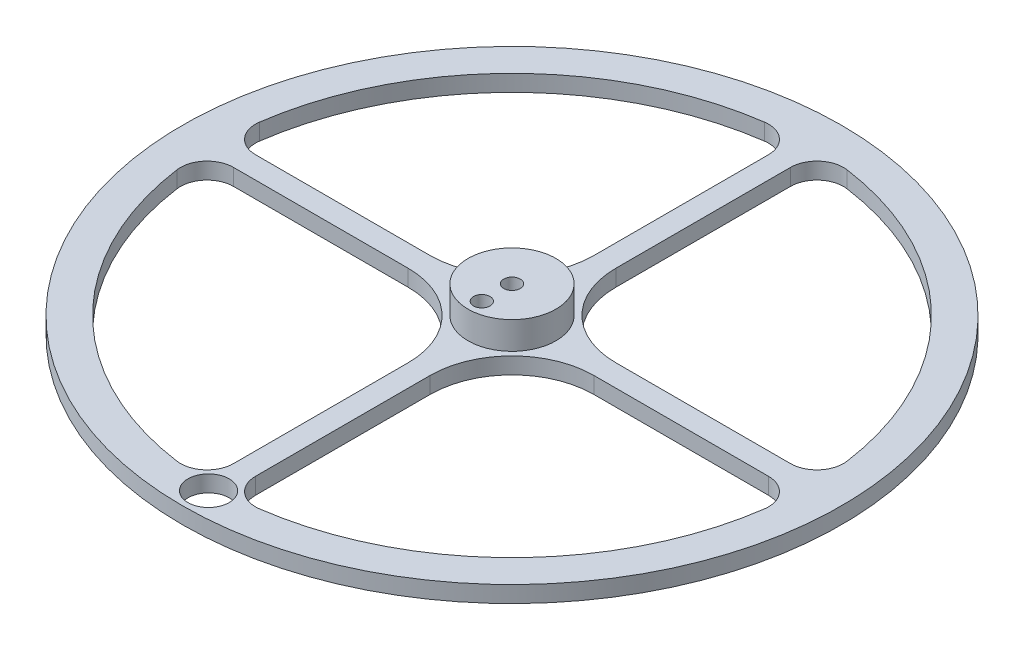
ISO-10303-21;
HEADER;
FILE_DESCRIPTION(('STEP AP214'),'2;1');
FILE_NAME('part.step','',(''),(''),'','','');
FILE_SCHEMA(('AUTOMOTIVE_DESIGN { 1 0 10303 214 1 1 1 1 }'));
ENDSEC;
DATA;
#1=APPLICATION_CONTEXT('core data for automotive mechanical design processes');
#2=APPLICATION_PROTOCOL_DEFINITION('international standard','automotive_design',2000,#1);
#3=PRODUCT_CONTEXT('',#1,'mechanical');
#4=PRODUCT('Part','Part','',(#3));
#5=PRODUCT_RELATED_PRODUCT_CATEGORY('part','',(#4));
#6=PRODUCT_DEFINITION_FORMATION('','',#4);
#7=PRODUCT_DEFINITION_CONTEXT('part definition',#1,'design');
#8=PRODUCT_DEFINITION('design','',#6,#7);
#9=PRODUCT_DEFINITION_SHAPE('','',#8);
#10=(LENGTH_UNIT() NAMED_UNIT(*) SI_UNIT(.MILLI.,.METRE.));
#11=(NAMED_UNIT(*) PLANE_ANGLE_UNIT() SI_UNIT($,.RADIAN.));
#12=(NAMED_UNIT(*) SI_UNIT($,.STERADIAN.) SOLID_ANGLE_UNIT());
#13=UNCERTAINTY_MEASURE_WITH_UNIT(LENGTH_MEASURE(1.E-05),#10,'distance_accuracy_value','');
#14=(GEOMETRIC_REPRESENTATION_CONTEXT(3) GLOBAL_UNCERTAINTY_ASSIGNED_CONTEXT((#13)) GLOBAL_UNIT_ASSIGNED_CONTEXT((#10,
#11,#12)) REPRESENTATION_CONTEXT('',''));
#15=CARTESIAN_POINT('',(0.,0.,0.));
#16=DIRECTION('',(0.,0.,1.));
#17=DIRECTION('',(1.,0.,0.));
#18=AXIS2_PLACEMENT_3D('',#15,#16,#17);
#19=CARTESIAN_POINT('',(0.,0.,0.));
#20=DIRECTION('',(0.,1.,0.));
#21=DIRECTION('',(0.,0.,1.));
#22=AXIS2_PLACEMENT_3D('',#19,#20,#21);
#23=PLANE('',#22);
#24=CARTESIAN_POINT('',(0.,0.,55.25));
#25=DIRECTION('',(0.,1.,0.));
#26=DIRECTION('',(0.,0.,1.));
#27=AXIS2_PLACEMENT_3D('',#24,#25,#26);
#28=CIRCLE('',#27,3.75);
#29=CARTESIAN_POINT('',(0.,0.,59.));
#30=VERTEX_POINT('',#29);
#31=EDGE_CURVE('E820',#30,#30,#28,.T.);
#32=ORIENTED_EDGE('',*,*,#31,.F.);
#33=EDGE_LOOP('',(#32));
#34=FACE_BOUND('',#33,.T.);
#35=CARTESIAN_POINT('',(0.,0.,0.));
#36=DIRECTION('',(0.,1.,0.));
#37=DIRECTION('',(0.,0.,1.));
#38=AXIS2_PLACEMENT_3D('',#35,#36,#37);
#39=CIRCLE('',#38,60.);
#40=CARTESIAN_POINT('',(0.,0.,60.));
#41=VERTEX_POINT('',#40);
#42=EDGE_CURVE('E249',#41,#41,#39,.T.);
#43=ORIENTED_EDGE('',*,*,#42,.T.);
#44=EDGE_LOOP('',(#43));
#45=FACE_BOUND('',#44,.T.);
#46=CARTESIAN_POINT('',(16.8994944431473,0.,16.8994944431475));
#47=DIRECTION('',(0.,1.,0.));
#48=DIRECTION('',(0.,0.,1.));
#49=AXIS2_PLACEMENT_3D('',#46,#47,#48);
#50=CIRCLE('',#49,14.8994942387478);
#51=CARTESIAN_POINT('',(16.8994944431474,0.,2.00000020439968));
#52=VERTEX_POINT('',#51);
#53=CARTESIAN_POINT('',(2.00000020439951,0.,16.8994944431475));
#54=VERTEX_POINT('',#53);
#55=EDGE_CURVE('E386',#52,#54,#50,.T.);
#56=ORIENTED_EDGE('',*,*,#55,.F.);
#57=DIRECTION('',(1.,0.,0.));
#58=VECTOR('',#57,1.);
#59=CARTESIAN_POINT('',(0.,0.,2.00000020439951));
#60=LINE('',#59,#58);
#61=CARTESIAN_POINT('',(48.6941677054723,0.,2.00000020440002));
#62=VERTEX_POINT('',#61);
#63=EDGE_CURVE('E389',#52,#62,#60,.T.);
#64=ORIENTED_EDGE('',*,*,#63,.T.);
#65=CARTESIAN_POINT('',(48.6941677054722,0.,6.82926831761021));
#66=DIRECTION('',(0.,1.,0.));
#67=DIRECTION('',(0.,0.,1.));
#68=AXIS2_PLACEMENT_3D('',#65,#66,#67);
#69=CIRCLE('',#68,4.82926811321019);
#70=CARTESIAN_POINT('',(53.4766304099276,0.,7.50000000000056));
#71=VERTEX_POINT('',#70);
#72=EDGE_CURVE('E393',#62,#71,#69,.F.);
#73=ORIENTED_EDGE('',*,*,#72,.T.);
#74=CARTESIAN_POINT('',(0.,0.,0.));
#75=DIRECTION('',(0.,1.,0.));
#76=DIRECTION('',(0.,0.,1.));
#77=AXIS2_PLACEMENT_3D('',#74,#75,#76);
#78=CIRCLE('',#77,54.);
#79=CARTESIAN_POINT('',(7.5,0.,53.4766304099277));
#80=VERTEX_POINT('',#79);
#81=EDGE_CURVE('E327',#80,#71,#78,.T.);
#82=ORIENTED_EDGE('',*,*,#81,.F.);
#83=CARTESIAN_POINT('',(6.8292683176097,0.,48.6941677054723));
#84=DIRECTION('',(0.,1.,0.));
#85=DIRECTION('',(0.,0.,1.));
#86=AXIS2_PLACEMENT_3D('',#83,#84,#85);
#87=CIRCLE('',#86,4.82926811321019);
#88=CARTESIAN_POINT('',(2.00000020439951,0.,48.6941677054723));
#89=VERTEX_POINT('',#88);
#90=EDGE_CURVE('E225',#89,#80,#87,.T.);
#91=ORIENTED_EDGE('',*,*,#90,.F.);
#92=DIRECTION('',(0.,0.,-1.));
#93=VECTOR('',#92,1.);
#94=CARTESIAN_POINT('',(2.00000020439951,0.,0.));
#95=LINE('',#94,#93);
#96=EDGE_CURVE('E257',#89,#54,#95,.T.);
#97=ORIENTED_EDGE('',*,*,#96,.T.);
#98=EDGE_LOOP('',(#56,#64,#73,#82,#91,#97));
#99=FACE_BOUND('',#98,.T.);
#100=CARTESIAN_POINT('',(53.4766304099277,0.,-7.49999999999944));
#101=VERTEX_POINT('',#100);
#102=CARTESIAN_POINT('',(7.50000000000037,0.,-53.4766304099276));
#103=VERTEX_POINT('',#102);
#104=EDGE_CURVE('E366',#101,#103,#78,.T.);
#105=ORIENTED_EDGE('',*,*,#104,.F.);
#106=CARTESIAN_POINT('',(48.6941677054724,0.,-6.82926831760919));
#107=DIRECTION('',(0.,1.,0.));
#108=DIRECTION('',(0.,0.,1.));
#109=AXIS2_PLACEMENT_3D('',#106,#107,#108);
#110=CIRCLE('',#109,4.82926811321019);
#111=CARTESIAN_POINT('',(48.6941677054723,0.,-2.000000204399));
#112=VERTEX_POINT('',#111);
#113=EDGE_CURVE('E367',#112,#101,#110,.T.);
#114=ORIENTED_EDGE('',*,*,#113,.F.);
#115=DIRECTION('',(-1.,0.,0.));
#116=VECTOR('',#115,1.);
#117=CARTESIAN_POINT('',(0.,0.,-2.00000020439951));
#118=LINE('',#117,#116);
#119=CARTESIAN_POINT('',(16.8994944431475,0.,-2.00000020439933));
#120=VERTEX_POINT('',#119);
#121=EDGE_CURVE('E370',#112,#120,#118,.T.);
#122=ORIENTED_EDGE('',*,*,#121,.T.);
#123=CARTESIAN_POINT('',(16.8994944431476,0.,-16.8994944431471));
#124=DIRECTION('',(0.,1.,0.));
#125=DIRECTION('',(0.,0.,1.));
#126=AXIS2_PLACEMENT_3D('',#123,#124,#125);
#127=CIRCLE('',#126,14.8994942387478);
#128=CARTESIAN_POINT('',(2.00000020439962,0.,-16.8994944431474));
#129=VERTEX_POINT('',#128);
#130=EDGE_CURVE('E374',#129,#120,#127,.T.);
#131=ORIENTED_EDGE('',*,*,#130,.F.);
#132=DIRECTION('',(0.,0.,-1.));
#133=VECTOR('',#132,1.);
#134=CARTESIAN_POINT('',(2.0000002043995,0.,0.));
#135=LINE('',#134,#133);
#136=CARTESIAN_POINT('',(2.00000020439984,0.,-48.6941677054723));
#137=VERTEX_POINT('',#136);
#138=EDGE_CURVE('E378',#129,#137,#135,.T.);
#139=ORIENTED_EDGE('',*,*,#138,.T.);
#140=CARTESIAN_POINT('',(6.82926831761003,0.,-48.6941677054722));
#141=DIRECTION('',(0.,1.,0.));
#142=DIRECTION('',(0.,0.,1.));
#143=AXIS2_PLACEMENT_3D('',#140,#141,#142);
#144=CIRCLE('',#143,4.82926811321019);
#145=EDGE_CURVE('E382',#137,#103,#144,.F.);
#146=ORIENTED_EDGE('',*,*,#145,.T.);
#147=EDGE_LOOP('',(#105,#114,#122,#131,#139,#146));
#148=FACE_BOUND('',#147,.T.);
#149=CARTESIAN_POINT('',(-7.49999999999963,0.,-53.4766304099277));
#150=VERTEX_POINT('',#149);
#151=CARTESIAN_POINT('',(-53.4766304099276,0.,-7.50000000000019));
#152=VERTEX_POINT('',#151);
#153=EDGE_CURVE('E328',#150,#152,#78,.T.);
#154=ORIENTED_EDGE('',*,*,#153,.F.);
#155=CARTESIAN_POINT('',(-6.82926831760936,0.,-48.6941677054723));
#156=DIRECTION('',(0.,1.,0.));
#157=DIRECTION('',(0.,0.,1.));
#158=AXIS2_PLACEMENT_3D('',#155,#156,#157);
#159=CIRCLE('',#158,4.82926811321019);
#160=CARTESIAN_POINT('',(-2.00000020439917,0.,-48.6941677054723));
#161=VERTEX_POINT('',#160);
#162=EDGE_CURVE('E347',#161,#150,#159,.T.);
#163=ORIENTED_EDGE('',*,*,#162,.F.);
#164=DIRECTION('',(0.,0.,1.));
#165=VECTOR('',#164,1.);
#166=CARTESIAN_POINT('',(-2.00000020439951,0.,0.));
#167=LINE('',#166,#165);
#168=CARTESIAN_POINT('',(-2.00000020439939,0.,-16.8994944431475));
#169=VERTEX_POINT('',#168);
#170=EDGE_CURVE('E350',#161,#169,#167,.T.);
#171=ORIENTED_EDGE('',*,*,#170,.T.);
#172=CARTESIAN_POINT('',(-16.8994944431471,0.,-16.8994944431476));
#173=DIRECTION('',(0.,1.,0.));
#174=DIRECTION('',(0.,0.,1.));
#175=AXIS2_PLACEMENT_3D('',#172,#173,#174);
#176=CIRCLE('',#175,14.8994942387478);
#177=CARTESIAN_POINT('',(-16.8994944431475,0.,-2.00000020439957));
#178=VERTEX_POINT('',#177);
#179=EDGE_CURVE('E354',#178,#169,#176,.T.);
#180=ORIENTED_EDGE('',*,*,#179,.F.);
#181=DIRECTION('',(-1.,0.,0.));
#182=VECTOR('',#181,1.);
#183=CARTESIAN_POINT('',(0.,0.,-2.00000020439951));
#184=LINE('',#183,#182);
#185=CARTESIAN_POINT('',(-48.6941677054723,0.,-2.00000020439968));
#186=VERTEX_POINT('',#185);
#187=EDGE_CURVE('E358',#178,#186,#184,.T.);
#188=ORIENTED_EDGE('',*,*,#187,.T.);
#189=CARTESIAN_POINT('',(-48.6941677054723,0.,-6.82926831760987));
#190=DIRECTION('',(0.,1.,0.));
#191=DIRECTION('',(0.,0.,1.));
#192=AXIS2_PLACEMENT_3D('',#189,#190,#191);
#193=CIRCLE('',#192,4.82926811321019);
#194=EDGE_CURVE('E362',#186,#152,#193,.F.);
#195=ORIENTED_EDGE('',*,*,#194,.T.);
#196=EDGE_LOOP('',(#154,#163,#171,#180,#188,#195));
#197=FACE_BOUND('',#196,.T.);
#198=CARTESIAN_POINT('',(-53.4766304099277,0.,7.49999999999981));
#199=VERTEX_POINT('',#198);
#200=CARTESIAN_POINT('',(-7.5,0.,53.4766304099277));
#201=VERTEX_POINT('',#200);
#202=EDGE_CURVE('E321',#199,#201,#78,.T.);
#203=ORIENTED_EDGE('',*,*,#202,.F.);
#204=CARTESIAN_POINT('',(-48.6941677054723,0.,6.82926831760953));
#205=DIRECTION('',(0.,1.,0.));
#206=DIRECTION('',(0.,0.,1.));
#207=AXIS2_PLACEMENT_3D('',#204,#205,#206);
#208=CIRCLE('',#207,4.8292681132102);
#209=CARTESIAN_POINT('',(-48.6941677054723,0.,2.00000020439934));
#210=VERTEX_POINT('',#209);
#211=EDGE_CURVE('E325',#210,#199,#208,.T.);
#212=ORIENTED_EDGE('',*,*,#211,.F.);
#213=DIRECTION('',(1.,0.,0.));
#214=VECTOR('',#213,1.);
#215=CARTESIAN_POINT('',(0.,0.,2.00000020439951));
#216=LINE('',#215,#214);
#217=CARTESIAN_POINT('',(-16.8994944431475,0.,2.00000020439945));
#218=VERTEX_POINT('',#217);
#219=EDGE_CURVE('E331',#210,#218,#216,.T.);
#220=ORIENTED_EDGE('',*,*,#219,.T.);
#221=CARTESIAN_POINT('',(-16.8994944431472,0.,16.8994944431475));
#222=DIRECTION('',(0.,1.,0.));
#223=DIRECTION('',(0.,0.,1.));
#224=AXIS2_PLACEMENT_3D('',#221,#222,#223);
#225=CIRCLE('',#224,14.8994942387477);
#226=CARTESIAN_POINT('',(-2.00000020439951,0.,16.8994944431475));
#227=VERTEX_POINT('',#226);
#228=EDGE_CURVE('E335',#227,#218,#225,.T.);
#229=ORIENTED_EDGE('',*,*,#228,.F.);
#230=DIRECTION('',(0.,0.,1.));
#231=VECTOR('',#230,1.);
#232=CARTESIAN_POINT('',(-2.00000020439951,0.,0.));
#233=LINE('',#232,#231);
#234=CARTESIAN_POINT('',(-2.00000020439951,0.,48.6941677054723));
#235=VERTEX_POINT('',#234);
#236=EDGE_CURVE('E339',#227,#235,#233,.T.);
#237=ORIENTED_EDGE('',*,*,#236,.T.);
#238=CARTESIAN_POINT('',(-6.8292683176097,0.,48.6941677054723));
#239=DIRECTION('',(0.,1.,0.));
#240=DIRECTION('',(0.,0.,1.));
#241=AXIS2_PLACEMENT_3D('',#238,#239,#240);
#242=CIRCLE('',#241,4.82926811321019);
#243=EDGE_CURVE('E343',#235,#201,#242,.F.);
#244=ORIENTED_EDGE('',*,*,#243,.T.);
#245=EDGE_LOOP('',(#203,#212,#220,#229,#237,#244));
#246=FACE_BOUND('',#245,.T.);
#247=CARTESIAN_POINT('',(0.,0.,0.));
#248=DIRECTION('',(0.,1.,0.));
#249=DIRECTION('',(0.,0.,1.));
#250=AXIS2_PLACEMENT_3D('',#247,#248,#249);
#251=CIRCLE('',#250,8.);
#252=CARTESIAN_POINT('',(0.,0.,8.));
#253=VERTEX_POINT('',#252);
#254=EDGE_CURVE('E842',#253,#253,#251,.T.);
#255=ORIENTED_EDGE('',*,*,#254,.F.);
#256=EDGE_LOOP('',(#255));
#257=FACE_BOUND('',#256,.T.);
#258=ADVANCED_FACE('F41',(#34,#45,#99,#148,#197,#246,#257),#23,.T.);
#259=CARTESIAN_POINT('',(16.8994944431473,-3.,16.8994944431475));
#260=DIRECTION('',(0.,1.,0.));
#261=DIRECTION('',(0.,0.,1.));
#262=AXIS2_PLACEMENT_3D('',#259,#260,#261);
#263=CYLINDRICAL_SURFACE('',#262,14.8994942387478);
#264=ORIENTED_EDGE('',*,*,#55,.T.);
#265=DIRECTION('',(0.,1.,0.));
#266=VECTOR('',#265,1.);
#267=CARTESIAN_POINT('',(2.00000020439951,-3.,16.8994944431475));
#268=LINE('',#267,#266);
#269=CARTESIAN_POINT('',(2.00000020439951,-3.,16.8994944431475));
#270=VERTEX_POINT('',#269);
#271=EDGE_CURVE('E11',#270,#54,#268,.T.);
#272=ORIENTED_EDGE('',*,*,#271,.F.);
#273=CARTESIAN_POINT('',(16.8994944431473,-3.,16.8994944431475));
#274=DIRECTION('',(0.,1.,0.));
#275=DIRECTION('',(0.,0.,1.));
#276=AXIS2_PLACEMENT_3D('',#273,#274,#275);
#277=CIRCLE('',#276,14.8994942387478);
#278=CARTESIAN_POINT('',(16.8994944431474,-3.,2.00000020439968));
#279=VERTEX_POINT('',#278);
#280=EDGE_CURVE('E61',#279,#270,#277,.T.);
#281=ORIENTED_EDGE('',*,*,#280,.F.);
#282=DIRECTION('',(0.,1.,0.));
#283=VECTOR('',#282,1.);
#284=CARTESIAN_POINT('',(16.8994944431474,-3.,2.00000020439968));
#285=LINE('',#284,#283);
#286=EDGE_CURVE('E409',#279,#52,#285,.T.);
#287=ORIENTED_EDGE('',*,*,#286,.T.);
#288=EDGE_LOOP('',(#264,#272,#281,#287));
#289=FACE_BOUND('',#288,.T.);
#290=ADVANCED_FACE('F530',(#289),#263,.F.);
#291=CARTESIAN_POINT('',(2.00000020439951,-3.,0.));
#292=DIRECTION('',(1.,0.,0.));
#293=DIRECTION('',(0.,0.,-1.));
#294=AXIS2_PLACEMENT_3D('',#291,#292,#293);
#295=PLANE('',#294);
#296=ORIENTED_EDGE('',*,*,#96,.F.);
#297=DIRECTION('',(0.,1.,0.));
#298=VECTOR('',#297,1.);
#299=CARTESIAN_POINT('',(2.00000020439951,-3.,48.6941677054723));
#300=LINE('',#299,#298);
#301=CARTESIAN_POINT('',(2.00000020439951,-3.,48.6941677054723));
#302=VERTEX_POINT('',#301);
#303=EDGE_CURVE('E52',#302,#89,#300,.T.);
#304=ORIENTED_EDGE('',*,*,#303,.F.);
#305=DIRECTION('',(0.,0.,-1.));
#306=VECTOR('',#305,1.);
#307=CARTESIAN_POINT('',(2.00000020439951,-3.,0.));
#308=LINE('',#307,#306);
#309=EDGE_CURVE('E219',#302,#270,#308,.T.);
#310=ORIENTED_EDGE('',*,*,#309,.T.);
#311=ORIENTED_EDGE('',*,*,#271,.T.);
#312=EDGE_LOOP('',(#296,#304,#310,#311));
#313=FACE_BOUND('',#312,.T.);
#314=ADVANCED_FACE('F531',(#313),#295,.T.);
#315=CARTESIAN_POINT('',(6.8292683176097,-3.,48.6941677054723));
#316=DIRECTION('',(0.,1.,0.));
#317=DIRECTION('',(0.,0.,1.));
#318=AXIS2_PLACEMENT_3D('',#315,#316,#317);
#319=CYLINDRICAL_SURFACE('',#318,4.82926811321019);
#320=ORIENTED_EDGE('',*,*,#90,.T.);
#321=DIRECTION('',(0.,1.,0.));
#322=VECTOR('',#321,1.);
#323=CARTESIAN_POINT('',(7.5,-3.,53.4766304099277));
#324=LINE('',#323,#322);
#325=CARTESIAN_POINT('',(7.5,-3.,53.4766304099277));
#326=VERTEX_POINT('',#325);
#327=EDGE_CURVE('E223',#326,#80,#324,.T.);
#328=ORIENTED_EDGE('',*,*,#327,.F.);
#329=CARTESIAN_POINT('',(6.8292683176097,-3.,48.6941677054723));
#330=DIRECTION('',(0.,1.,0.));
#331=DIRECTION('',(0.,0.,1.));
#332=AXIS2_PLACEMENT_3D('',#329,#330,#331);
#333=CIRCLE('',#332,4.82926811321019);
#334=EDGE_CURVE('E211',#302,#326,#333,.T.);
#335=ORIENTED_EDGE('',*,*,#334,.F.);
#336=ORIENTED_EDGE('',*,*,#303,.T.);
#337=EDGE_LOOP('',(#320,#328,#335,#336));
#338=FACE_BOUND('',#337,.T.);
#339=ADVANCED_FACE('F224',(#338),#319,.F.);
#340=CARTESIAN_POINT('',(0.,-3.,0.));
#341=DIRECTION('',(0.,1.,0.));
#342=DIRECTION('',(0.,0.,1.));
#343=AXIS2_PLACEMENT_3D('',#340,#341,#342);
#344=CYLINDRICAL_SURFACE('',#343,54.);
#345=ORIENTED_EDGE('',*,*,#81,.T.);
#346=DIRECTION('',(0.,1.,0.));
#347=VECTOR('',#346,1.);
#348=CARTESIAN_POINT('',(53.4766304099276,-3.,7.50000000000056));
#349=LINE('',#348,#347);
#350=CARTESIAN_POINT('',(53.4766304099276,-3.,7.50000000000056));
#351=VERTEX_POINT('',#350);
#352=EDGE_CURVE('E230',#351,#71,#349,.T.);
#353=ORIENTED_EDGE('',*,*,#352,.F.);
#354=CARTESIAN_POINT('',(0.,-3.,0.));
#355=DIRECTION('',(0.,1.,0.));
#356=DIRECTION('',(0.,0.,1.));
#357=AXIS2_PLACEMENT_3D('',#354,#355,#356);
#358=CIRCLE('',#357,54.);
#359=EDGE_CURVE('E217',#326,#351,#358,.T.);
#360=ORIENTED_EDGE('',*,*,#359,.F.);
#361=ORIENTED_EDGE('',*,*,#327,.T.);
#362=EDGE_LOOP('',(#345,#353,#360,#361));
#363=FACE_BOUND('',#362,.T.);
#364=ADVANCED_FACE('F232',(#363),#344,.F.);
#365=CARTESIAN_POINT('',(48.6941677054722,-3.,6.82926831761021));
#366=DIRECTION('',(0.,1.,0.));
#367=DIRECTION('',(0.,0.,1.));
#368=AXIS2_PLACEMENT_3D('',#365,#366,#367);
#369=CYLINDRICAL_SURFACE('',#368,4.82926811321019);
#370=ORIENTED_EDGE('',*,*,#72,.F.);
#371=DIRECTION('',(0.,1.,0.));
#372=VECTOR('',#371,1.);
#373=CARTESIAN_POINT('',(48.6941677054723,-3.,2.00000020440002));
#374=LINE('',#373,#372);
#375=CARTESIAN_POINT('',(48.6941677054723,-3.,2.00000020440002));
#376=VERTEX_POINT('',#375);
#377=EDGE_CURVE('E406',#376,#62,#374,.T.);
#378=ORIENTED_EDGE('',*,*,#377,.F.);
#379=CARTESIAN_POINT('',(48.6941677054722,-3.,6.82926831761021));
#380=DIRECTION('',(0.,1.,0.));
#381=DIRECTION('',(0.,0.,1.));
#382=AXIS2_PLACEMENT_3D('',#379,#380,#381);
#383=CIRCLE('',#382,4.82926811321019);
#384=EDGE_CURVE('E235',#376,#351,#383,.F.);
#385=ORIENTED_EDGE('',*,*,#384,.T.);
#386=ORIENTED_EDGE('',*,*,#352,.T.);
#387=EDGE_LOOP('',(#370,#378,#385,#386));
#388=FACE_BOUND('',#387,.T.);
#389=ADVANCED_FACE('F526',(#388),#369,.F.);
#390=ORIENTED_EDGE('',*,*,#104,.T.);
#391=DIRECTION('',(0.,1.,0.));
#392=VECTOR('',#391,1.);
#393=CARTESIAN_POINT('',(7.50000000000037,-3.,-53.4766304099276));
#394=LINE('',#393,#392);
#395=CARTESIAN_POINT('',(7.50000000000037,-3.,-53.4766304099276));
#396=VERTEX_POINT('',#395);
#397=EDGE_CURVE('E412',#396,#103,#394,.T.);
#398=ORIENTED_EDGE('',*,*,#397,.F.);
#399=CARTESIAN_POINT('',(53.4766304099277,-3.,-7.49999999999944));
#400=VERTEX_POINT('',#399);
#401=EDGE_CURVE('E237',#400,#396,#358,.T.);
#402=ORIENTED_EDGE('',*,*,#401,.F.);
#403=DIRECTION('',(0.,1.,0.));
#404=VECTOR('',#403,1.);
#405=CARTESIAN_POINT('',(53.4766304099277,-3.,-7.49999999999944));
#406=LINE('',#405,#404);
#407=EDGE_CURVE('E427',#400,#101,#406,.T.);
#408=ORIENTED_EDGE('',*,*,#407,.T.);
#409=EDGE_LOOP('',(#390,#398,#402,#408));
#410=FACE_BOUND('',#409,.T.);
#411=ADVANCED_FACE('F496',(#410),#344,.F.);
#412=CARTESIAN_POINT('',(6.82926831761003,-3.,-48.6941677054722));
#413=DIRECTION('',(0.,1.,0.));
#414=DIRECTION('',(0.,0.,1.));
#415=AXIS2_PLACEMENT_3D('',#412,#413,#414);
#416=CYLINDRICAL_SURFACE('',#415,4.82926811321019);
#417=ORIENTED_EDGE('',*,*,#145,.F.);
#418=DIRECTION('',(0.,1.,0.));
#419=VECTOR('',#418,1.);
#420=CARTESIAN_POINT('',(2.00000020439984,-3.,-48.6941677054723));
#421=LINE('',#420,#419);
#422=CARTESIAN_POINT('',(2.00000020439984,-3.,-48.6941677054723));
#423=VERTEX_POINT('',#422);
#424=EDGE_CURVE('E415',#423,#137,#421,.T.);
#425=ORIENTED_EDGE('',*,*,#424,.F.);
#426=CARTESIAN_POINT('',(6.82926831761003,-3.,-48.6941677054722));
#427=DIRECTION('',(0.,1.,0.));
#428=DIRECTION('',(0.,0.,1.));
#429=AXIS2_PLACEMENT_3D('',#426,#427,#428);
#430=CIRCLE('',#429,4.82926811321019);
#431=EDGE_CURVE('E306',#423,#396,#430,.F.);
#432=ORIENTED_EDGE('',*,*,#431,.T.);
#433=ORIENTED_EDGE('',*,*,#397,.T.);
#434=EDGE_LOOP('',(#417,#425,#432,#433));
#435=FACE_BOUND('',#434,.T.);
#436=ADVANCED_FACE('F500',(#435),#416,.F.);
#437=CARTESIAN_POINT('',(2.0000002043995,-3.,0.));
#438=DIRECTION('',(1.,0.,0.));
#439=DIRECTION('',(0.,0.,-1.));
#440=AXIS2_PLACEMENT_3D('',#437,#438,#439);
#441=PLANE('',#440);
#442=ORIENTED_EDGE('',*,*,#138,.F.);
#443=DIRECTION('',(0.,1.,0.));
#444=VECTOR('',#443,1.);
#445=CARTESIAN_POINT('',(2.00000020439962,-3.,-16.8994944431474));
#446=LINE('',#445,#444);
#447=CARTESIAN_POINT('',(2.00000020439962,-3.,-16.8994944431474));
#448=VERTEX_POINT('',#447);
#449=EDGE_CURVE('E418',#448,#129,#446,.T.);
#450=ORIENTED_EDGE('',*,*,#449,.F.);
#451=DIRECTION('',(0.,0.,-1.));
#452=VECTOR('',#451,1.);
#453=CARTESIAN_POINT('',(2.0000002043995,-3.,0.));
#454=LINE('',#453,#452);
#455=EDGE_CURVE('E302',#448,#423,#454,.T.);
#456=ORIENTED_EDGE('',*,*,#455,.T.);
#457=ORIENTED_EDGE('',*,*,#424,.T.);
#458=EDGE_LOOP('',(#442,#450,#456,#457));
#459=FACE_BOUND('',#458,.T.);
#460=ADVANCED_FACE('F503',(#459),#441,.T.);
#461=CARTESIAN_POINT('',(16.8994944431476,-3.,-16.8994944431471));
#462=DIRECTION('',(0.,1.,0.));
#463=DIRECTION('',(0.,0.,1.));
#464=AXIS2_PLACEMENT_3D('',#461,#462,#463);
#465=CYLINDRICAL_SURFACE('',#464,14.8994942387478);
#466=ORIENTED_EDGE('',*,*,#130,.T.);
#467=DIRECTION('',(0.,1.,0.));
#468=VECTOR('',#467,1.);
#469=CARTESIAN_POINT('',(16.8994944431475,-3.,-2.00000020439933));
#470=LINE('',#469,#468);
#471=CARTESIAN_POINT('',(16.8994944431475,-3.,-2.00000020439933));
#472=VERTEX_POINT('',#471);
#473=EDGE_CURVE('E421',#472,#120,#470,.T.);
#474=ORIENTED_EDGE('',*,*,#473,.F.);
#475=CARTESIAN_POINT('',(16.8994944431476,-3.,-16.8994944431471));
#476=DIRECTION('',(0.,1.,0.));
#477=DIRECTION('',(0.,0.,1.));
#478=AXIS2_PLACEMENT_3D('',#475,#476,#477);
#479=CIRCLE('',#478,14.8994942387478);
#480=EDGE_CURVE('E299',#448,#472,#479,.T.);
#481=ORIENTED_EDGE('',*,*,#480,.F.);
#482=ORIENTED_EDGE('',*,*,#449,.T.);
#483=EDGE_LOOP('',(#466,#474,#481,#482));
#484=FACE_BOUND('',#483,.T.);
#485=ADVANCED_FACE('F507',(#484),#465,.F.);
#486=CARTESIAN_POINT('',(0.,-3.,-2.00000020439951));
#487=DIRECTION('',(0.,0.,-1.));
#488=DIRECTION('',(-1.,0.,0.));
#489=AXIS2_PLACEMENT_3D('',#486,#487,#488);
#490=PLANE('',#489);
#491=ORIENTED_EDGE('',*,*,#121,.F.);
#492=DIRECTION('',(0.,1.,0.));
#493=VECTOR('',#492,1.);
#494=CARTESIAN_POINT('',(48.6941677054723,-3.,-2.000000204399));
#495=LINE('',#494,#493);
#496=CARTESIAN_POINT('',(48.6941677054723,-3.,-2.000000204399));
#497=VERTEX_POINT('',#496);
#498=EDGE_CURVE('E424',#497,#112,#495,.T.);
#499=ORIENTED_EDGE('',*,*,#498,.F.);
#500=DIRECTION('',(-1.,0.,0.));
#501=VECTOR('',#500,1.);
#502=CARTESIAN_POINT('',(0.,-3.,-2.00000020439951));
#503=LINE('',#502,#501);
#504=EDGE_CURVE('E295',#497,#472,#503,.T.);
#505=ORIENTED_EDGE('',*,*,#504,.T.);
#506=ORIENTED_EDGE('',*,*,#473,.T.);
#507=EDGE_LOOP('',(#491,#499,#505,#506));
#508=FACE_BOUND('',#507,.T.);
#509=ADVANCED_FACE('F511',(#508),#490,.T.);
#510=ORIENTED_EDGE('',*,*,#153,.T.);
#511=DIRECTION('',(0.,1.,0.));
#512=VECTOR('',#511,1.);
#513=CARTESIAN_POINT('',(-53.4766304099276,-3.,-7.50000000000019));
#514=LINE('',#513,#512);
#515=CARTESIAN_POINT('',(-53.4766304099276,-3.,-7.50000000000019));
#516=VERTEX_POINT('',#515);
#517=EDGE_CURVE('E431',#516,#152,#514,.T.);
#518=ORIENTED_EDGE('',*,*,#517,.F.);
#519=CARTESIAN_POINT('',(-7.49999999999963,-3.,-53.4766304099277));
#520=VERTEX_POINT('',#519);
#521=EDGE_CURVE('E247',#520,#516,#358,.T.);
#522=ORIENTED_EDGE('',*,*,#521,.F.);
#523=DIRECTION('',(0.,1.,0.));
#524=VECTOR('',#523,1.);
#525=CARTESIAN_POINT('',(-7.49999999999963,-3.,-53.4766304099277));
#526=LINE('',#525,#524);
#527=EDGE_CURVE('E446',#520,#150,#526,.T.);
#528=ORIENTED_EDGE('',*,*,#527,.T.);
#529=EDGE_LOOP('',(#510,#518,#522,#528));
#530=FACE_BOUND('',#529,.T.);
#531=ADVANCED_FACE('F602',(#530),#344,.F.);
#532=CARTESIAN_POINT('',(-48.6941677054723,-3.,-6.82926831760987));
#533=DIRECTION('',(0.,1.,0.));
#534=DIRECTION('',(0.,0.,1.));
#535=AXIS2_PLACEMENT_3D('',#532,#533,#534);
#536=CYLINDRICAL_SURFACE('',#535,4.82926811321019);
#537=ORIENTED_EDGE('',*,*,#194,.F.);
#538=DIRECTION('',(0.,1.,0.));
#539=VECTOR('',#538,1.);
#540=CARTESIAN_POINT('',(-48.6941677054723,-3.,-2.00000020439968));
#541=LINE('',#540,#539);
#542=CARTESIAN_POINT('',(-48.6941677054723,-3.,-2.00000020439968));
#543=VERTEX_POINT('',#542);
#544=EDGE_CURVE('E434',#543,#186,#541,.T.);
#545=ORIENTED_EDGE('',*,*,#544,.F.);
#546=CARTESIAN_POINT('',(-48.6941677054723,-3.,-6.82926831760987));
#547=DIRECTION('',(0.,1.,0.));
#548=DIRECTION('',(0.,0.,1.));
#549=AXIS2_PLACEMENT_3D('',#546,#547,#548);
#550=CIRCLE('',#549,4.82926811321019);
#551=EDGE_CURVE('E246',#543,#516,#550,.F.);
#552=ORIENTED_EDGE('',*,*,#551,.T.);
#553=ORIENTED_EDGE('',*,*,#517,.T.);
#554=EDGE_LOOP('',(#537,#545,#552,#553));
#555=FACE_BOUND('',#554,.T.);
#556=ADVANCED_FACE('F604',(#555),#536,.F.);
#557=CARTESIAN_POINT('',(0.,-3.,-2.00000020439951));
#558=DIRECTION('',(0.,0.,-1.));
#559=DIRECTION('',(-1.,0.,0.));
#560=AXIS2_PLACEMENT_3D('',#557,#558,#559);
#561=PLANE('',#560);
#562=ORIENTED_EDGE('',*,*,#187,.F.);
#563=DIRECTION('',(0.,1.,0.));
#564=VECTOR('',#563,1.);
#565=CARTESIAN_POINT('',(-16.8994944431475,-3.,-2.00000020439957));
#566=LINE('',#565,#564);
#567=CARTESIAN_POINT('',(-16.8994944431475,-3.,-2.00000020439957));
#568=VERTEX_POINT('',#567);
#569=EDGE_CURVE('E437',#568,#178,#566,.T.);
#570=ORIENTED_EDGE('',*,*,#569,.F.);
#571=DIRECTION('',(-1.,0.,0.));
#572=VECTOR('',#571,1.);
#573=CARTESIAN_POINT('',(0.,-3.,-2.00000020439951));
#574=LINE('',#573,#572);
#575=EDGE_CURVE('E286',#568,#543,#574,.T.);
#576=ORIENTED_EDGE('',*,*,#575,.T.);
#577=ORIENTED_EDGE('',*,*,#544,.T.);
#578=EDGE_LOOP('',(#562,#570,#576,#577));
#579=FACE_BOUND('',#578,.T.);
#580=ADVANCED_FACE('F607',(#579),#561,.T.);
#581=CARTESIAN_POINT('',(-16.8994944431471,-3.,-16.8994944431476));
#582=DIRECTION('',(0.,1.,0.));
#583=DIRECTION('',(0.,0.,1.));
#584=AXIS2_PLACEMENT_3D('',#581,#582,#583);
#585=CYLINDRICAL_SURFACE('',#584,14.8994942387478);
#586=ORIENTED_EDGE('',*,*,#179,.T.);
#587=DIRECTION('',(0.,1.,0.));
#588=VECTOR('',#587,1.);
#589=CARTESIAN_POINT('',(-2.00000020439939,-3.,-16.8994944431475));
#590=LINE('',#589,#588);
#591=CARTESIAN_POINT('',(-2.00000020439939,-3.,-16.8994944431475));
#592=VERTEX_POINT('',#591);
#593=EDGE_CURVE('E440',#592,#169,#590,.T.);
#594=ORIENTED_EDGE('',*,*,#593,.F.);
#595=CARTESIAN_POINT('',(-16.8994944431471,-3.,-16.8994944431476));
#596=DIRECTION('',(0.,1.,0.));
#597=DIRECTION('',(0.,0.,1.));
#598=AXIS2_PLACEMENT_3D('',#595,#596,#597);
#599=CIRCLE('',#598,14.8994942387478);
#600=EDGE_CURVE('E283',#568,#592,#599,.T.);
#601=ORIENTED_EDGE('',*,*,#600,.F.);
#602=ORIENTED_EDGE('',*,*,#569,.T.);
#603=EDGE_LOOP('',(#586,#594,#601,#602));
#604=FACE_BOUND('',#603,.T.);
#605=ADVANCED_FACE('F610',(#604),#585,.F.);
#606=CARTESIAN_POINT('',(-2.00000020439951,-3.,0.));
#607=DIRECTION('',(-1.,0.,0.));
#608=DIRECTION('',(0.,0.,1.));
#609=AXIS2_PLACEMENT_3D('',#606,#607,#608);
#610=PLANE('',#609);
#611=ORIENTED_EDGE('',*,*,#170,.F.);
#612=DIRECTION('',(0.,1.,0.));
#613=VECTOR('',#612,1.);
#614=CARTESIAN_POINT('',(-2.00000020439917,-3.,-48.6941677054723));
#615=LINE('',#614,#613);
#616=CARTESIAN_POINT('',(-2.00000020439917,-3.,-48.6941677054723));
#617=VERTEX_POINT('',#616);
#618=EDGE_CURVE('E443',#617,#161,#615,.T.);
#619=ORIENTED_EDGE('',*,*,#618,.F.);
#620=DIRECTION('',(0.,0.,1.));
#621=VECTOR('',#620,1.);
#622=CARTESIAN_POINT('',(-2.00000020439951,-3.,0.));
#623=LINE('',#622,#621);
#624=EDGE_CURVE('E268',#617,#592,#623,.T.);
#625=ORIENTED_EDGE('',*,*,#624,.T.);
#626=ORIENTED_EDGE('',*,*,#593,.T.);
#627=EDGE_LOOP('',(#611,#619,#625,#626));
#628=FACE_BOUND('',#627,.T.);
#629=ADVANCED_FACE('F569',(#628),#610,.T.);
#630=ORIENTED_EDGE('',*,*,#202,.T.);
#631=DIRECTION('',(0.,1.,0.));
#632=VECTOR('',#631,1.);
#633=CARTESIAN_POINT('',(-7.5,-3.,53.4766304099277));
#634=LINE('',#633,#632);
#635=CARTESIAN_POINT('',(-7.5,-3.,53.4766304099277));
#636=VERTEX_POINT('',#635);
#637=EDGE_CURVE('E450',#636,#201,#634,.T.);
#638=ORIENTED_EDGE('',*,*,#637,.F.);
#639=CARTESIAN_POINT('',(-53.4766304099277,-3.,7.49999999999981));
#640=VERTEX_POINT('',#639);
#641=EDGE_CURVE('E238',#640,#636,#358,.T.);
#642=ORIENTED_EDGE('',*,*,#641,.F.);
#643=DIRECTION('',(0.,1.,0.));
#644=VECTOR('',#643,1.);
#645=CARTESIAN_POINT('',(-53.4766304099277,-3.,7.49999999999981));
#646=LINE('',#645,#644);
#647=EDGE_CURVE('E45',#640,#199,#646,.T.);
#648=ORIENTED_EDGE('',*,*,#647,.T.);
#649=EDGE_LOOP('',(#630,#638,#642,#648));
#650=FACE_BOUND('',#649,.T.);
#651=ADVANCED_FACE('F469',(#650),#344,.F.);
#652=CARTESIAN_POINT('',(-6.8292683176097,-3.,48.6941677054723));
#653=DIRECTION('',(0.,1.,0.));
#654=DIRECTION('',(0.,0.,1.));
#655=AXIS2_PLACEMENT_3D('',#652,#653,#654);
#656=CYLINDRICAL_SURFACE('',#655,4.82926811321019);
#657=ORIENTED_EDGE('',*,*,#243,.F.);
#658=DIRECTION('',(0.,1.,0.));
#659=VECTOR('',#658,1.);
#660=CARTESIAN_POINT('',(-2.00000020439951,-3.,48.6941677054723));
#661=LINE('',#660,#659);
#662=CARTESIAN_POINT('',(-2.00000020439951,-3.,48.6941677054723));
#663=VERTEX_POINT('',#662);
#664=EDGE_CURVE('E453',#663,#235,#661,.T.);
#665=ORIENTED_EDGE('',*,*,#664,.F.);
#666=CARTESIAN_POINT('',(-6.8292683176097,-3.,48.6941677054723));
#667=DIRECTION('',(0.,1.,0.));
#668=DIRECTION('',(0.,0.,1.));
#669=AXIS2_PLACEMENT_3D('',#666,#667,#668);
#670=CIRCLE('',#669,4.82926811321019);
#671=EDGE_CURVE('E261',#663,#636,#670,.F.);
#672=ORIENTED_EDGE('',*,*,#671,.T.);
#673=ORIENTED_EDGE('',*,*,#637,.T.);
#674=EDGE_LOOP('',(#657,#665,#672,#673));
#675=FACE_BOUND('',#674,.T.);
#676=ADVANCED_FACE('F476',(#675),#656,.F.);
#677=CARTESIAN_POINT('',(-2.00000020439951,-3.,0.));
#678=DIRECTION('',(-1.,0.,0.));
#679=DIRECTION('',(0.,0.,1.));
#680=AXIS2_PLACEMENT_3D('',#677,#678,#679);
#681=PLANE('',#680);
#682=ORIENTED_EDGE('',*,*,#236,.F.);
#683=DIRECTION('',(0.,1.,0.));
#684=VECTOR('',#683,1.);
#685=CARTESIAN_POINT('',(-2.00000020439951,-3.,16.8994944431475));
#686=LINE('',#685,#684);
#687=CARTESIAN_POINT('',(-2.00000020439951,-3.,16.8994944431475));
#688=VERTEX_POINT('',#687);
#689=EDGE_CURVE('E456',#688,#227,#686,.T.);
#690=ORIENTED_EDGE('',*,*,#689,.F.);
#691=DIRECTION('',(0.,0.,1.));
#692=VECTOR('',#691,1.);
#693=CARTESIAN_POINT('',(-2.00000020439951,-3.,0.));
#694=LINE('',#693,#692);
#695=EDGE_CURVE('E271',#688,#663,#694,.T.);
#696=ORIENTED_EDGE('',*,*,#695,.T.);
#697=ORIENTED_EDGE('',*,*,#664,.T.);
#698=EDGE_LOOP('',(#682,#690,#696,#697));
#699=FACE_BOUND('',#698,.T.);
#700=ADVANCED_FACE('F479',(#699),#681,.T.);
#701=CARTESIAN_POINT('',(-16.8994944431472,-3.,16.8994944431475));
#702=DIRECTION('',(0.,1.,0.));
#703=DIRECTION('',(0.,0.,1.));
#704=AXIS2_PLACEMENT_3D('',#701,#702,#703);
#705=CYLINDRICAL_SURFACE('',#704,14.8994942387477);
#706=ORIENTED_EDGE('',*,*,#228,.T.);
#707=DIRECTION('',(0.,1.,0.));
#708=VECTOR('',#707,1.);
#709=CARTESIAN_POINT('',(-16.8994944431475,-3.,2.00000020439945));
#710=LINE('',#709,#708);
#711=CARTESIAN_POINT('',(-16.8994944431475,-3.,2.00000020439945));
#712=VERTEX_POINT('',#711);
#713=EDGE_CURVE('E459',#712,#218,#710,.T.);
#714=ORIENTED_EDGE('',*,*,#713,.F.);
#715=CARTESIAN_POINT('',(-16.8994944431472,-3.,16.8994944431475));
#716=DIRECTION('',(0.,1.,0.));
#717=DIRECTION('',(0.,0.,1.));
#718=AXIS2_PLACEMENT_3D('',#715,#716,#717);
#719=CIRCLE('',#718,14.8994942387477);
#720=EDGE_CURVE('E276',#688,#712,#719,.T.);
#721=ORIENTED_EDGE('',*,*,#720,.F.);
#722=ORIENTED_EDGE('',*,*,#689,.T.);
#723=EDGE_LOOP('',(#706,#714,#721,#722));
#724=FACE_BOUND('',#723,.T.);
#725=ADVANCED_FACE('F575',(#724),#705,.F.);
#726=CARTESIAN_POINT('',(0.,-3.,2.00000020439951));
#727=DIRECTION('',(0.,0.,1.));
#728=DIRECTION('',(1.,0.,0.));
#729=AXIS2_PLACEMENT_3D('',#726,#727,#728);
#730=PLANE('',#729);
#731=ORIENTED_EDGE('',*,*,#219,.F.);
#732=DIRECTION('',(0.,1.,0.));
#733=VECTOR('',#732,1.);
#734=CARTESIAN_POINT('',(-48.6941677054723,-3.,2.00000020439934));
#735=LINE('',#734,#733);
#736=CARTESIAN_POINT('',(-48.6941677054723,-3.,2.00000020439934));
#737=VERTEX_POINT('',#736);
#738=EDGE_CURVE('E461',#737,#210,#735,.T.);
#739=ORIENTED_EDGE('',*,*,#738,.F.);
#740=DIRECTION('',(1.,0.,0.));
#741=VECTOR('',#740,1.);
#742=CARTESIAN_POINT('',(0.,-3.,2.00000020439951));
#743=LINE('',#742,#741);
#744=EDGE_CURVE('E255',#737,#712,#743,.T.);
#745=ORIENTED_EDGE('',*,*,#744,.T.);
#746=ORIENTED_EDGE('',*,*,#713,.T.);
#747=EDGE_LOOP('',(#731,#739,#745,#746));
#748=FACE_BOUND('',#747,.T.);
#749=ADVANCED_FACE('F577',(#748),#730,.T.);
#750=CARTESIAN_POINT('',(0.,-3.,2.00000020439951));
#751=DIRECTION('',(0.,0.,1.));
#752=DIRECTION('',(1.,0.,0.));
#753=AXIS2_PLACEMENT_3D('',#750,#751,#752);
#754=PLANE('',#753);
#755=ORIENTED_EDGE('',*,*,#63,.F.);
#756=ORIENTED_EDGE('',*,*,#286,.F.);
#757=DIRECTION('',(1.,0.,0.));
#758=VECTOR('',#757,1.);
#759=CARTESIAN_POINT('',(0.,-3.,2.00000020439951));
#760=LINE('',#759,#758);
#761=EDGE_CURVE('E240',#279,#376,#760,.T.);
#762=ORIENTED_EDGE('',*,*,#761,.T.);
#763=ORIENTED_EDGE('',*,*,#377,.T.);
#764=EDGE_LOOP('',(#755,#756,#762,#763));
#765=FACE_BOUND('',#764,.T.);
#766=ADVANCED_FACE('F528',(#765),#754,.T.);
#767=CARTESIAN_POINT('',(48.6941677054724,-3.,-6.82926831760919));
#768=DIRECTION('',(0.,1.,0.));
#769=DIRECTION('',(0.,0.,1.));
#770=AXIS2_PLACEMENT_3D('',#767,#768,#769);
#771=CYLINDRICAL_SURFACE('',#770,4.82926811321019);
#772=ORIENTED_EDGE('',*,*,#113,.T.);
#773=ORIENTED_EDGE('',*,*,#407,.F.);
#774=CARTESIAN_POINT('',(48.6941677054724,-3.,-6.82926831760919));
#775=DIRECTION('',(0.,1.,0.));
#776=DIRECTION('',(0.,0.,1.));
#777=AXIS2_PLACEMENT_3D('',#774,#775,#776);
#778=CIRCLE('',#777,4.82926811321019);
#779=EDGE_CURVE('E245',#497,#400,#778,.T.);
#780=ORIENTED_EDGE('',*,*,#779,.F.);
#781=ORIENTED_EDGE('',*,*,#498,.T.);
#782=EDGE_LOOP('',(#772,#773,#780,#781));
#783=FACE_BOUND('',#782,.T.);
#784=ADVANCED_FACE('F514',(#783),#771,.F.);
#785=CARTESIAN_POINT('',(-6.82926831760936,-3.,-48.6941677054723));
#786=DIRECTION('',(0.,1.,0.));
#787=DIRECTION('',(0.,0.,1.));
#788=AXIS2_PLACEMENT_3D('',#785,#786,#787);
#789=CYLINDRICAL_SURFACE('',#788,4.82926811321019);
#790=ORIENTED_EDGE('',*,*,#162,.T.);
#791=ORIENTED_EDGE('',*,*,#527,.F.);
#792=CARTESIAN_POINT('',(-6.82926831760936,-3.,-48.6941677054723));
#793=DIRECTION('',(0.,1.,0.));
#794=DIRECTION('',(0.,0.,1.));
#795=AXIS2_PLACEMENT_3D('',#792,#793,#794);
#796=CIRCLE('',#795,4.82926811321019);
#797=EDGE_CURVE('E260',#617,#520,#796,.T.);
#798=ORIENTED_EDGE('',*,*,#797,.F.);
#799=ORIENTED_EDGE('',*,*,#618,.T.);
#800=EDGE_LOOP('',(#790,#791,#798,#799));
#801=FACE_BOUND('',#800,.T.);
#802=ADVANCED_FACE('F554',(#801),#789,.F.);
#803=CARTESIAN_POINT('',(-48.6941677054723,-3.,6.82926831760953));
#804=DIRECTION('',(0.,1.,0.));
#805=DIRECTION('',(0.,0.,1.));
#806=AXIS2_PLACEMENT_3D('',#803,#804,#805);
#807=CYLINDRICAL_SURFACE('',#806,4.8292681132102);
#808=ORIENTED_EDGE('',*,*,#211,.T.);
#809=ORIENTED_EDGE('',*,*,#647,.F.);
#810=CARTESIAN_POINT('',(-48.6941677054723,-3.,6.82926831760953));
#811=DIRECTION('',(0.,1.,0.));
#812=DIRECTION('',(0.,0.,1.));
#813=AXIS2_PLACEMENT_3D('',#810,#811,#812);
#814=CIRCLE('',#813,4.8292681132102);
#815=EDGE_CURVE('E150',#737,#640,#814,.T.);
#816=ORIENTED_EDGE('',*,*,#815,.F.);
#817=ORIENTED_EDGE('',*,*,#738,.T.);
#818=EDGE_LOOP('',(#808,#809,#816,#817));
#819=FACE_BOUND('',#818,.T.);
#820=ADVANCED_FACE('F43',(#819),#807,.F.);
#821=CARTESIAN_POINT('',(0.,-3.,0.));
#822=DIRECTION('',(0.,1.,0.));
#823=DIRECTION('',(0.,0.,1.));
#824=AXIS2_PLACEMENT_3D('',#821,#822,#823);
#825=CYLINDRICAL_SURFACE('',#824,60.);
#826=CARTESIAN_POINT('',(0.,-3.,0.));
#827=DIRECTION('',(0.,1.,0.));
#828=DIRECTION('',(0.,0.,1.));
#829=AXIS2_PLACEMENT_3D('',#826,#827,#828);
#830=CIRCLE('',#829,60.);
#831=CARTESIAN_POINT('',(0.,-3.,60.));
#832=VERTEX_POINT('',#831);
#833=EDGE_CURVE('E317',#832,#832,#830,.T.);
#834=ORIENTED_EDGE('',*,*,#833,.T.);
#835=EDGE_LOOP('',(#834));
#836=FACE_BOUND('',#835,.T.);
#837=ORIENTED_EDGE('',*,*,#42,.F.);
#838=EDGE_LOOP('',(#837));
#839=FACE_BOUND('',#838,.T.);
#840=ADVANCED_FACE('F483',(#836,#839),#825,.T.);
#841=CARTESIAN_POINT('',(0.,-3.,0.));
#842=DIRECTION('',(0.,1.,0.));
#843=DIRECTION('',(0.,0.,1.));
#844=AXIS2_PLACEMENT_3D('',#841,#842,#843);
#845=PLANE('',#844);
#846=CARTESIAN_POINT('',(0.,-3.,55.25));
#847=DIRECTION('',(0.,1.,0.));
#848=DIRECTION('',(0.,0.,1.));
#849=AXIS2_PLACEMENT_3D('',#846,#847,#848);
#850=CIRCLE('',#849,3.75);
#851=CARTESIAN_POINT('',(0.,-3.,59.));
#852=VERTEX_POINT('',#851);
#853=EDGE_CURVE('E826',#852,#852,#850,.F.);
#854=ORIENTED_EDGE('',*,*,#853,.F.);
#855=EDGE_LOOP('',(#854));
#856=FACE_BOUND('',#855,.T.);
#857=CARTESIAN_POINT('',(0.,-3.,0.));
#858=DIRECTION('',(0.,1.,0.));
#859=DIRECTION('',(0.,0.,1.));
#860=AXIS2_PLACEMENT_3D('',#857,#858,#859);
#861=CIRCLE('',#860,1.5);
#862=CARTESIAN_POINT('',(0.,-3.,1.5));
#863=VERTEX_POINT('',#862);
#864=EDGE_CURVE('E838',#863,#863,#861,.F.);
#865=ORIENTED_EDGE('',*,*,#864,.F.);
#866=EDGE_LOOP('',(#865));
#867=FACE_BOUND('',#866,.T.);
#868=ORIENTED_EDGE('',*,*,#641,.T.);
#869=ORIENTED_EDGE('',*,*,#671,.F.);
#870=ORIENTED_EDGE('',*,*,#695,.F.);
#871=ORIENTED_EDGE('',*,*,#720,.T.);
#872=ORIENTED_EDGE('',*,*,#744,.F.);
#873=ORIENTED_EDGE('',*,*,#815,.T.);
#874=EDGE_LOOP('',(#868,#869,#870,#871,#872,#873));
#875=FACE_BOUND('',#874,.T.);
#876=ORIENTED_EDGE('',*,*,#521,.T.);
#877=ORIENTED_EDGE('',*,*,#551,.F.);
#878=ORIENTED_EDGE('',*,*,#575,.F.);
#879=ORIENTED_EDGE('',*,*,#600,.T.);
#880=ORIENTED_EDGE('',*,*,#624,.F.);
#881=ORIENTED_EDGE('',*,*,#797,.T.);
#882=EDGE_LOOP('',(#876,#877,#878,#879,#880,#881));
#883=FACE_BOUND('',#882,.T.);
#884=ORIENTED_EDGE('',*,*,#401,.T.);
#885=ORIENTED_EDGE('',*,*,#431,.F.);
#886=ORIENTED_EDGE('',*,*,#455,.F.);
#887=ORIENTED_EDGE('',*,*,#480,.T.);
#888=ORIENTED_EDGE('',*,*,#504,.F.);
#889=ORIENTED_EDGE('',*,*,#779,.T.);
#890=EDGE_LOOP('',(#884,#885,#886,#887,#888,#889));
#891=FACE_BOUND('',#890,.T.);
#892=ORIENTED_EDGE('',*,*,#280,.T.);
#893=ORIENTED_EDGE('',*,*,#309,.F.);
#894=ORIENTED_EDGE('',*,*,#334,.T.);
#895=ORIENTED_EDGE('',*,*,#359,.T.);
#896=ORIENTED_EDGE('',*,*,#384,.F.);
#897=ORIENTED_EDGE('',*,*,#761,.F.);
#898=EDGE_LOOP('',(#892,#893,#894,#895,#896,#897));
#899=FACE_BOUND('',#898,.T.);
#900=ORIENTED_EDGE('',*,*,#833,.F.);
#901=EDGE_LOOP('',(#900));
#902=FACE_BOUND('',#901,.T.);
#903=ADVANCED_FACE('F213',(#856,#867,#875,#883,#891,#899,#902),#845,.F.);
#904=CARTESIAN_POINT('',(0.,5.,0.));
#905=DIRECTION('',(0.,-1.,0.));
#906=DIRECTION('',(0.,0.,-1.));
#907=AXIS2_PLACEMENT_3D('',#904,#905,#906);
#908=CYLINDRICAL_SURFACE('',#907,8.);
#909=CARTESIAN_POINT('',(0.,5.,0.));
#910=DIRECTION('',(0.,1.,0.));
#911=DIRECTION('',(0.,0.,1.));
#912=AXIS2_PLACEMENT_3D('',#909,#910,#911);
#913=CIRCLE('',#912,8.);
#914=CARTESIAN_POINT('',(0.,5.,8.));
#915=VERTEX_POINT('',#914);
#916=EDGE_CURVE('E326',#915,#915,#913,.T.);
#917=ORIENTED_EDGE('',*,*,#916,.F.);
#918=EDGE_LOOP('',(#917));
#919=FACE_BOUND('',#918,.T.);
#920=ORIENTED_EDGE('',*,*,#254,.T.);
#921=EDGE_LOOP('',(#920));
#922=FACE_BOUND('',#921,.T.);
#923=ADVANCED_FACE('F482',(#919,#922),#908,.T.);
#924=CARTESIAN_POINT('',(0.,5.,0.));
#925=DIRECTION('',(0.,1.,0.));
#926=DIRECTION('',(0.,0.,1.));
#927=AXIS2_PLACEMENT_3D('',#924,#925,#926);
#928=PLANE('',#927);
#929=CARTESIAN_POINT('',(0.,5.,5.5));
#930=DIRECTION('',(0.,1.,0.));
#931=DIRECTION('',(0.,0.,1.));
#932=AXIS2_PLACEMENT_3D('',#929,#930,#931);
#933=CIRCLE('',#932,1.5);
#934=CARTESIAN_POINT('',(0.,5.,7.));
#935=VERTEX_POINT('',#934);
#936=EDGE_CURVE('E821',#935,#935,#933,.T.);
#937=ORIENTED_EDGE('',*,*,#936,.F.);
#938=EDGE_LOOP('',(#937));
#939=FACE_BOUND('',#938,.T.);
#940=CARTESIAN_POINT('',(0.,5.,0.));
#941=DIRECTION('',(0.,1.,0.));
#942=DIRECTION('',(0.,0.,1.));
#943=AXIS2_PLACEMENT_3D('',#940,#941,#942);
#944=CIRCLE('',#943,1.5);
#945=CARTESIAN_POINT('',(0.,5.,1.5));
#946=VERTEX_POINT('',#945);
#947=EDGE_CURVE('E834',#946,#946,#944,.T.);
#948=ORIENTED_EDGE('',*,*,#947,.F.);
#949=EDGE_LOOP('',(#948));
#950=FACE_BOUND('',#949,.T.);
#951=ORIENTED_EDGE('',*,*,#916,.T.);
#952=EDGE_LOOP('',(#951));
#953=FACE_BOUND('',#952,.T.);
#954=ADVANCED_FACE('F750',(#939,#950,#953),#928,.T.);
#955=CARTESIAN_POINT('',(0.,-3.001,0.));
#956=DIRECTION('',(0.,1.,0.));
#957=DIRECTION('',(0.,0.,1.));
#958=AXIS2_PLACEMENT_3D('',#955,#956,#957);
#959=CYLINDRICAL_SURFACE('',#958,1.5);
#960=ORIENTED_EDGE('',*,*,#947,.T.);
#961=EDGE_LOOP('',(#960));
#962=FACE_BOUND('',#961,.T.);
#963=ORIENTED_EDGE('',*,*,#864,.T.);
#964=EDGE_LOOP('',(#963));
#965=FACE_BOUND('',#964,.T.);
#966=ADVANCED_FACE('F758',(#962,#965),#959,.F.);
#967=CARTESIAN_POINT('',(0.,-3.001,55.25));
#968=DIRECTION('',(0.,1.,0.));
#969=DIRECTION('',(0.,0.,1.));
#970=AXIS2_PLACEMENT_3D('',#967,#968,#969);
#971=CYLINDRICAL_SURFACE('',#970,3.75);
#972=ORIENTED_EDGE('',*,*,#31,.T.);
#973=EDGE_LOOP('',(#972));
#974=FACE_BOUND('',#973,.T.);
#975=ORIENTED_EDGE('',*,*,#853,.T.);
#976=EDGE_LOOP('',(#975));
#977=FACE_BOUND('',#976,.T.);
#978=ADVANCED_FACE('F762',(#974,#977),#971,.F.);
#979=CARTESIAN_POINT('',(0.,-4.24264068711929,5.5));
#980=DIRECTION('',(0.,1.,0.));
#981=DIRECTION('',(0.,0.,1.));
#982=AXIS2_PLACEMENT_3D('',#979,#980,#981);
#983=CYLINDRICAL_SURFACE('',#982,1.5);
#984=CARTESIAN_POINT('',(0.,0.,5.5));
#985=DIRECTION('',(0.,1.,0.));
#986=DIRECTION('',(0.,0.,1.));
#987=AXIS2_PLACEMENT_3D('',#984,#985,#986);
#988=CIRCLE('',#987,1.5);
#989=CARTESIAN_POINT('',(0.,0.,7.));
#990=VERTEX_POINT('',#989);
#991=EDGE_CURVE('E818',#990,#990,#988,.F.);
#992=ORIENTED_EDGE('',*,*,#991,.T.);
#993=EDGE_LOOP('',(#992));
#994=FACE_BOUND('',#993,.T.);
#995=ORIENTED_EDGE('',*,*,#936,.T.);
#996=EDGE_LOOP('',(#995));
#997=FACE_BOUND('',#996,.T.);
#998=ADVANCED_FACE('F785',(#994,#997),#983,.F.);
#999=CARTESIAN_POINT('',(0.,0.,0.));
#1000=DIRECTION('',(0.,1.,0.));
#1001=DIRECTION('',(0.,0.,1.));
#1002=AXIS2_PLACEMENT_3D('',#999,#1000,#1001);
#1003=PLANE('',#1002);
#1004=ORIENTED_EDGE('',*,*,#991,.F.);
#1005=EDGE_LOOP('',(#1004));
#1006=FACE_BOUND('',#1005,.T.);
#1007=ADVANCED_FACE('F802',(#1006),#1003,.T.);
#1008=CLOSED_SHELL('',(#258,#290,#314,#339,#364,#389,#411,#436,#460,#485,#509,#531,#556,#580,
#605,#629,#651,#676,#700,#725,#749,#766,#784,#802,#820,#840,#903,#923,#954,#966,#978,#998,#1007));
#1009=MANIFOLD_SOLID_BREP('B2',#1008);
#1010=ADVANCED_BREP_SHAPE_REPRESENTATION('',(#18,#1009),#14);
#1011=SHAPE_DEFINITION_REPRESENTATION(#9,#1010);
ENDSEC;
END-ISO-10303-21;
